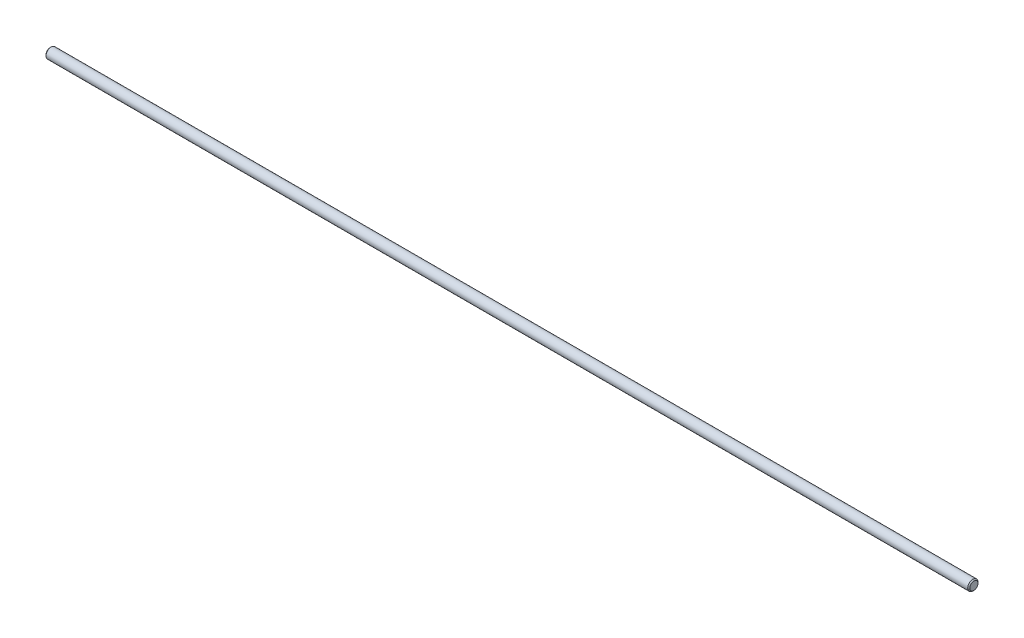
ISO-10303-21;
HEADER;
FILE_DESCRIPTION(('STEP AP214'),'2;1');
FILE_NAME('part.step','',(''),(''),'','','');
FILE_SCHEMA(('AUTOMOTIVE_DESIGN { 1 0 10303 214 1 1 1 1 }'));
ENDSEC;
DATA;
#1=APPLICATION_CONTEXT('core data for automotive mechanical design processes');
#2=APPLICATION_PROTOCOL_DEFINITION('international standard','automotive_design',2000,#1);
#3=PRODUCT_CONTEXT('',#1,'mechanical');
#4=PRODUCT('Part','Part','',(#3));
#5=PRODUCT_RELATED_PRODUCT_CATEGORY('part','',(#4));
#6=PRODUCT_DEFINITION_FORMATION('','',#4);
#7=PRODUCT_DEFINITION_CONTEXT('part definition',#1,'design');
#8=PRODUCT_DEFINITION('design','',#6,#7);
#9=PRODUCT_DEFINITION_SHAPE('','',#8);
#10=(LENGTH_UNIT() NAMED_UNIT(*) SI_UNIT(.MILLI.,.METRE.));
#11=(NAMED_UNIT(*) PLANE_ANGLE_UNIT() SI_UNIT($,.RADIAN.));
#12=(NAMED_UNIT(*) SI_UNIT($,.STERADIAN.) SOLID_ANGLE_UNIT());
#13=UNCERTAINTY_MEASURE_WITH_UNIT(LENGTH_MEASURE(1.E-05),#10,'distance_accuracy_value','');
#14=(GEOMETRIC_REPRESENTATION_CONTEXT(3) GLOBAL_UNCERTAINTY_ASSIGNED_CONTEXT((#13)) GLOBAL_UNIT_ASSIGNED_CONTEXT((#10,
#11,#12)) REPRESENTATION_CONTEXT('',''));
#15=CARTESIAN_POINT('',(0.,0.,0.));
#16=DIRECTION('',(0.,0.,1.));
#17=DIRECTION('',(1.,0.,0.));
#18=AXIS2_PLACEMENT_3D('',#15,#16,#17);
#19=CARTESIAN_POINT('',(450.,0.,0.));
#20=DIRECTION('',(-1.,0.,0.));
#21=DIRECTION('',(0.,0.,1.));
#22=AXIS2_PLACEMENT_3D('',#19,#20,#21);
#23=CYLINDRICAL_SURFACE('',#22,2.5);
#24=CARTESIAN_POINT('',(449.5,0.,0.));
#25=DIRECTION('',(1.,0.,0.));
#26=DIRECTION('',(0.,0.,-1.));
#27=AXIS2_PLACEMENT_3D('',#24,#25,#26);
#28=CIRCLE('',#27,2.5);
#29=CARTESIAN_POINT('',(449.5,0.,-2.5));
#30=VERTEX_POINT('',#29);
#31=EDGE_CURVE('E38',#30,#30,#28,.F.);
#32=ORIENTED_EDGE('',*,*,#31,.T.);
#33=EDGE_LOOP('',(#32));
#34=FACE_BOUND('',#33,.T.);
#35=CARTESIAN_POINT('',(0.500000000000111,0.,0.));
#36=DIRECTION('',(1.,0.,0.));
#37=DIRECTION('',(0.,0.,-1.));
#38=AXIS2_PLACEMENT_3D('',#35,#36,#37);
#39=CIRCLE('',#38,2.5);
#40=CARTESIAN_POINT('',(0.500000000000111,0.,-2.5));
#41=VERTEX_POINT('',#40);
#42=EDGE_CURVE('E42',#41,#41,#39,.T.);
#43=ORIENTED_EDGE('',*,*,#42,.T.);
#44=EDGE_LOOP('',(#43));
#45=FACE_BOUND('',#44,.T.);
#46=ADVANCED_FACE('F31',(#34,#45),#23,.T.);
#47=CARTESIAN_POINT('',(450.,0.,0.));
#48=DIRECTION('',(1.,0.,0.));
#49=DIRECTION('',(0.,0.,-1.));
#50=AXIS2_PLACEMENT_3D('',#47,#48,#49);
#51=PLANE('',#50);
#52=CARTESIAN_POINT('',(450.,0.,0.));
#53=DIRECTION('',(1.,0.,0.));
#54=DIRECTION('',(0.,0.,-1.));
#55=AXIS2_PLACEMENT_3D('',#52,#53,#54);
#56=CIRCLE('',#55,1.99999999999995);
#57=CARTESIAN_POINT('',(450.,0.,-1.99999999999995));
#58=VERTEX_POINT('',#57);
#59=EDGE_CURVE('E46',#58,#58,#56,.T.);
#60=ORIENTED_EDGE('',*,*,#59,.T.);
#61=EDGE_LOOP('',(#60));
#62=FACE_BOUND('',#61,.T.);
#63=ADVANCED_FACE('F52',(#62),#51,.T.);
#64=CARTESIAN_POINT('',(0.,0.,0.));
#65=DIRECTION('',(1.,0.,0.));
#66=DIRECTION('',(0.,0.,-1.));
#67=AXIS2_PLACEMENT_3D('',#64,#65,#66);
#68=PLANE('',#67);
#69=CARTESIAN_POINT('',(0.,0.,0.));
#70=DIRECTION('',(1.,0.,0.));
#71=DIRECTION('',(0.,0.,-1.));
#72=AXIS2_PLACEMENT_3D('',#69,#70,#71);
#73=CIRCLE('',#72,1.99999999999989);
#74=CARTESIAN_POINT('',(0.,0.,-1.99999999999989));
#75=VERTEX_POINT('',#74);
#76=EDGE_CURVE('E10',#75,#75,#73,.F.);
#77=ORIENTED_EDGE('',*,*,#76,.T.);
#78=EDGE_LOOP('',(#77));
#79=FACE_BOUND('',#78,.T.);
#80=ADVANCED_FACE('F56',(#79),#68,.F.);
#81=CARTESIAN_POINT('',(450.,0.,0.));
#82=DIRECTION('',(-1.,0.,0.));
#83=DIRECTION('',(0.,0.,1.));
#84=AXIS2_PLACEMENT_3D('',#81,#82,#83);
#85=CONICAL_SURFACE('',#84,1.99999999999995,0.785398163397446);
#86=ORIENTED_EDGE('',*,*,#31,.F.);
#87=EDGE_LOOP('',(#86));
#88=FACE_BOUND('',#87,.T.);
#89=ORIENTED_EDGE('',*,*,#59,.F.);
#90=EDGE_LOOP('',(#89));
#91=FACE_BOUND('',#90,.T.);
#92=ADVANCED_FACE('F54',(#88,#91),#85,.T.);
#93=CARTESIAN_POINT('',(0.500000000000111,0.,0.));
#94=DIRECTION('',(1.,0.,0.));
#95=DIRECTION('',(0.,0.,-1.));
#96=AXIS2_PLACEMENT_3D('',#93,#94,#95);
#97=CONICAL_SURFACE('',#96,2.5,0.785398163397446);
#98=ORIENTED_EDGE('',*,*,#76,.F.);
#99=EDGE_LOOP('',(#98));
#100=FACE_BOUND('',#99,.T.);
#101=ORIENTED_EDGE('',*,*,#42,.F.);
#102=EDGE_LOOP('',(#101));
#103=FACE_BOUND('',#102,.T.);
#104=ADVANCED_FACE('F33',(#100,#103),#97,.T.);
#105=CLOSED_SHELL('',(#46,#63,#80,#92,#104));
#106=MANIFOLD_SOLID_BREP('B2',#105);
#107=ADVANCED_BREP_SHAPE_REPRESENTATION('',(#18,#106),#14);
#108=SHAPE_DEFINITION_REPRESENTATION(#9,#107);
ENDSEC;
END-ISO-10303-21;
